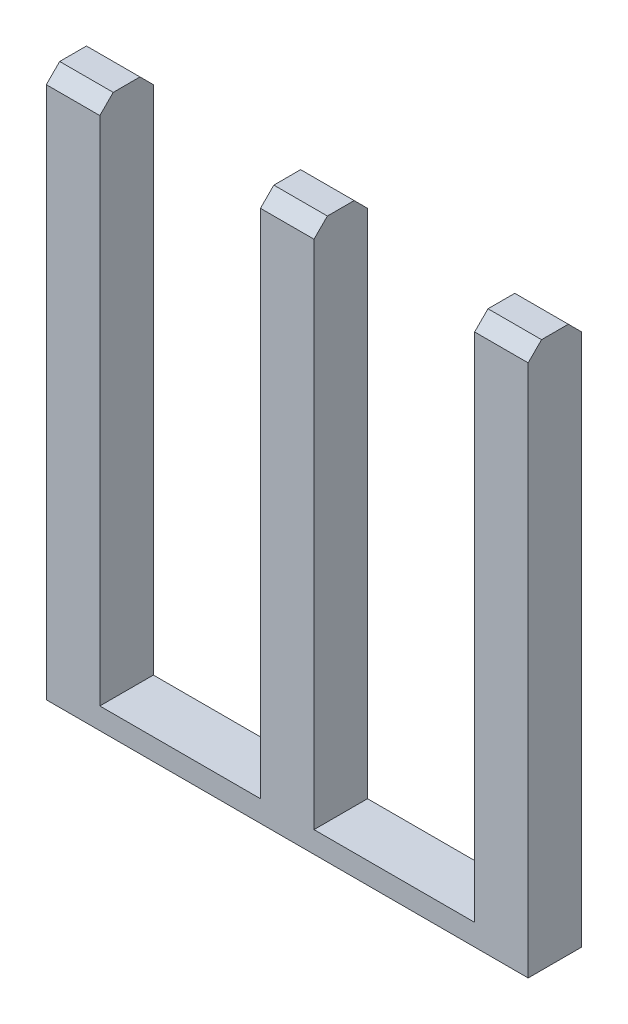
ISO-10303-21;
HEADER;
FILE_DESCRIPTION(('STEP AP214'),'2;1');
FILE_NAME('part.step','',(''),(''),'','','');
FILE_SCHEMA(('AUTOMOTIVE_DESIGN { 1 0 10303 214 1 1 1 1 }'));
ENDSEC;
DATA;
#1=APPLICATION_CONTEXT('core data for automotive mechanical design processes');
#2=APPLICATION_PROTOCOL_DEFINITION('international standard','automotive_design',2000,#1);
#3=PRODUCT_CONTEXT('',#1,'mechanical');
#4=PRODUCT('Part','Part','',(#3));
#5=PRODUCT_RELATED_PRODUCT_CATEGORY('part','',(#4));
#6=PRODUCT_DEFINITION_FORMATION('','',#4);
#7=PRODUCT_DEFINITION_CONTEXT('part definition',#1,'design');
#8=PRODUCT_DEFINITION('design','',#6,#7);
#9=PRODUCT_DEFINITION_SHAPE('','',#8);
#10=(LENGTH_UNIT() NAMED_UNIT(*) SI_UNIT(.MILLI.,.METRE.));
#11=(NAMED_UNIT(*) PLANE_ANGLE_UNIT() SI_UNIT($,.RADIAN.));
#12=(NAMED_UNIT(*) SI_UNIT($,.STERADIAN.) SOLID_ANGLE_UNIT());
#13=UNCERTAINTY_MEASURE_WITH_UNIT(LENGTH_MEASURE(1.E-05),#10,'distance_accuracy_value','');
#14=(GEOMETRIC_REPRESENTATION_CONTEXT(3) GLOBAL_UNCERTAINTY_ASSIGNED_CONTEXT((#13)) GLOBAL_UNIT_ASSIGNED_CONTEXT((#10,
#11,#12)) REPRESENTATION_CONTEXT('',''));
#15=CARTESIAN_POINT('',(0.,0.,0.));
#16=DIRECTION('',(0.,0.,1.));
#17=DIRECTION('',(1.,0.,0.));
#18=AXIS2_PLACEMENT_3D('',#15,#16,#17);
#19=CARTESIAN_POINT('',(2.8575,1.27000000000001,0.0635));
#20=DIRECTION('',(0.,0.,1.));
#21=DIRECTION('',(0.,1.,0.));
#22=AXIS2_PLACEMENT_3D('',#19,#20,#21);
#23=PLANE('',#22);
#24=DIRECTION('',(1.,0.,0.));
#25=VECTOR('',#24,1.);
#26=CARTESIAN_POINT('',(-2.8575,1.27000000000001,0.0635));
#27=LINE('',#26,#25);
#28=CARTESIAN_POINT('',(2.8575,1.27000000000001,0.0635));
#29=VERTEX_POINT('',#28);
#30=CARTESIAN_POINT('',(-2.8575,1.27000000000001,0.0635));
#31=VERTEX_POINT('',#30);
#32=EDGE_CURVE('E142',#29,#31,#27,.F.);
#33=ORIENTED_EDGE('',*,*,#32,.F.);
#34=DIRECTION('',(0.,1.,0.));
#35=VECTOR('',#34,1.);
#36=CARTESIAN_POINT('',(2.8575,1.27000000000001,0.0635));
#37=LINE('',#36,#35);
#38=CARTESIAN_POINT('',(2.8575,7.58825,0.0635));
#39=VERTEX_POINT('',#38);
#40=EDGE_CURVE('E157',#39,#29,#37,.F.);
#41=ORIENTED_EDGE('',*,*,#40,.F.);
#42=DIRECTION('',(-1.,0.,0.));
#43=VECTOR('',#42,1.);
#44=CARTESIAN_POINT('',(2.8575,7.58825,0.0635));
#45=LINE('',#44,#43);
#46=CARTESIAN_POINT('',(2.2225,7.58825,0.0635));
#47=VERTEX_POINT('',#46);
#48=EDGE_CURVE('E166',#39,#47,#45,.T.);
#49=ORIENTED_EDGE('',*,*,#48,.T.);
#50=DIRECTION('',(0.,-1.,0.));
#51=VECTOR('',#50,1.);
#52=CARTESIAN_POINT('',(2.2225,7.58825,0.0635));
#53=LINE('',#52,#51);
#54=CARTESIAN_POINT('',(2.2225,1.524,0.0635));
#55=VERTEX_POINT('',#54);
#56=EDGE_CURVE('E168',#55,#47,#53,.F.);
#57=ORIENTED_EDGE('',*,*,#56,.F.);
#58=DIRECTION('',(-1.,0.,0.));
#59=VECTOR('',#58,1.);
#60=CARTESIAN_POINT('',(2.2225,1.524,0.0635));
#61=LINE('',#60,#59);
#62=CARTESIAN_POINT('',(0.3175,1.524,0.0635));
#63=VERTEX_POINT('',#62);
#64=EDGE_CURVE('E178',#63,#55,#61,.F.);
#65=ORIENTED_EDGE('',*,*,#64,.F.);
#66=DIRECTION('',(0.,1.,0.));
#67=VECTOR('',#66,1.);
#68=CARTESIAN_POINT('',(0.3175,1.524,0.0635));
#69=LINE('',#68,#67);
#70=CARTESIAN_POINT('',(0.3175,7.58825,0.0635));
#71=VERTEX_POINT('',#70);
#72=EDGE_CURVE('E182',#71,#63,#69,.F.);
#73=ORIENTED_EDGE('',*,*,#72,.F.);
#74=DIRECTION('',(-1.,0.,0.));
#75=VECTOR('',#74,1.);
#76=CARTESIAN_POINT('',(0.3175,7.58825,0.0635));
#77=LINE('',#76,#75);
#78=CARTESIAN_POINT('',(-0.3175,7.58825,0.0635));
#79=VERTEX_POINT('',#78);
#80=EDGE_CURVE('E187',#71,#79,#77,.T.);
#81=ORIENTED_EDGE('',*,*,#80,.T.);
#82=DIRECTION('',(0.,-1.,0.));
#83=VECTOR('',#82,1.);
#84=CARTESIAN_POINT('',(-0.3175,7.58825,0.0635));
#85=LINE('',#84,#83);
#86=CARTESIAN_POINT('',(-0.3175,1.524,0.0635));
#87=VERTEX_POINT('',#86);
#88=EDGE_CURVE('E192',#87,#79,#85,.F.);
#89=ORIENTED_EDGE('',*,*,#88,.F.);
#90=DIRECTION('',(-1.,0.,0.));
#91=VECTOR('',#90,1.);
#92=CARTESIAN_POINT('',(-0.3175,1.524,0.0635));
#93=LINE('',#92,#91);
#94=CARTESIAN_POINT('',(-2.2225,1.524,0.0635));
#95=VERTEX_POINT('',#94);
#96=EDGE_CURVE('E196',#95,#87,#93,.F.);
#97=ORIENTED_EDGE('',*,*,#96,.F.);
#98=DIRECTION('',(0.,1.,0.));
#99=VECTOR('',#98,1.);
#100=CARTESIAN_POINT('',(-2.2225,1.524,0.0635));
#101=LINE('',#100,#99);
#102=CARTESIAN_POINT('',(-2.2225,7.58825,0.0635));
#103=VERTEX_POINT('',#102);
#104=EDGE_CURVE('E201',#103,#95,#101,.F.);
#105=ORIENTED_EDGE('',*,*,#104,.F.);
#106=DIRECTION('',(-1.,0.,0.));
#107=VECTOR('',#106,1.);
#108=CARTESIAN_POINT('',(-2.2225,7.58825,0.0635));
#109=LINE('',#108,#107);
#110=CARTESIAN_POINT('',(-2.8575,7.58825,0.0635));
#111=VERTEX_POINT('',#110);
#112=EDGE_CURVE('E205',#103,#111,#109,.T.);
#113=ORIENTED_EDGE('',*,*,#112,.T.);
#114=DIRECTION('',(0.,-1.,0.));
#115=VECTOR('',#114,1.);
#116=CARTESIAN_POINT('',(-2.8575,7.58825,0.0635));
#117=LINE('',#116,#115);
#118=EDGE_CURVE('E160',#111,#31,#117,.T.);
#119=ORIENTED_EDGE('',*,*,#118,.T.);
#120=EDGE_LOOP('',(#33,#41,#49,#57,#65,#73,#81,#89,#97,#105,#113,#119));
#121=FACE_BOUND('',#120,.T.);
#122=ADVANCED_FACE('F16',(#121),#23,.T.);
#123=CARTESIAN_POINT('',(-2.8575,1.27000000000001,-0.5715));
#124=DIRECTION('',(0.,0.,-1.));
#125=DIRECTION('',(0.,1.,0.));
#126=AXIS2_PLACEMENT_3D('',#123,#124,#125);
#127=PLANE('',#126);
#128=DIRECTION('',(-1.,0.,0.));
#129=VECTOR('',#128,1.);
#130=CARTESIAN_POINT('',(2.8575,1.27000000000001,-0.5715));
#131=LINE('',#130,#129);
#132=CARTESIAN_POINT('',(-2.8575,1.27000000000001,-0.5715));
#133=VERTEX_POINT('',#132);
#134=CARTESIAN_POINT('',(2.8575,1.27000000000001,-0.5715));
#135=VERTEX_POINT('',#134);
#136=EDGE_CURVE('E145',#133,#135,#131,.F.);
#137=ORIENTED_EDGE('',*,*,#136,.F.);
#138=DIRECTION('',(0.,1.,0.));
#139=VECTOR('',#138,1.);
#140=CARTESIAN_POINT('',(-2.8575,1.27000000000001,-0.5715));
#141=LINE('',#140,#139);
#142=CARTESIAN_POINT('',(-2.8575,7.58825,-0.5715));
#143=VERTEX_POINT('',#142);
#144=EDGE_CURVE('E215',#133,#143,#141,.T.);
#145=ORIENTED_EDGE('',*,*,#144,.T.);
#146=DIRECTION('',(1.,0.,0.));
#147=VECTOR('',#146,1.);
#148=CARTESIAN_POINT('',(-2.8575,7.58825,-0.5715));
#149=LINE('',#148,#147);
#150=CARTESIAN_POINT('',(-2.2225,7.58825,-0.5715));
#151=VERTEX_POINT('',#150);
#152=EDGE_CURVE('E220',#151,#143,#149,.F.);
#153=ORIENTED_EDGE('',*,*,#152,.F.);
#154=DIRECTION('',(0.,-1.,0.));
#155=VECTOR('',#154,1.);
#156=CARTESIAN_POINT('',(-2.2225,7.58825,-0.5715));
#157=LINE('',#156,#155);
#158=CARTESIAN_POINT('',(-2.2225,1.524,-0.5715));
#159=VERTEX_POINT('',#158);
#160=EDGE_CURVE('E224',#159,#151,#157,.F.);
#161=ORIENTED_EDGE('',*,*,#160,.F.);
#162=DIRECTION('',(1.,0.,0.));
#163=VECTOR('',#162,1.);
#164=CARTESIAN_POINT('',(-2.2225,1.524,-0.5715));
#165=LINE('',#164,#163);
#166=CARTESIAN_POINT('',(-0.3175,1.524,-0.5715));
#167=VERTEX_POINT('',#166);
#168=EDGE_CURVE('E228',#167,#159,#165,.F.);
#169=ORIENTED_EDGE('',*,*,#168,.F.);
#170=DIRECTION('',(0.,1.,0.));
#171=VECTOR('',#170,1.);
#172=CARTESIAN_POINT('',(-0.3175,1.524,-0.5715));
#173=LINE('',#172,#171);
#174=CARTESIAN_POINT('',(-0.3175,7.58825,-0.5715));
#175=VERTEX_POINT('',#174);
#176=EDGE_CURVE('E233',#175,#167,#173,.F.);
#177=ORIENTED_EDGE('',*,*,#176,.F.);
#178=DIRECTION('',(1.,0.,0.));
#179=VECTOR('',#178,1.);
#180=CARTESIAN_POINT('',(-0.3175,7.58825,-0.5715));
#181=LINE('',#180,#179);
#182=CARTESIAN_POINT('',(0.3175,7.58825,-0.5715));
#183=VERTEX_POINT('',#182);
#184=EDGE_CURVE('E237',#183,#175,#181,.F.);
#185=ORIENTED_EDGE('',*,*,#184,.F.);
#186=DIRECTION('',(0.,-1.,0.));
#187=VECTOR('',#186,1.);
#188=CARTESIAN_POINT('',(0.3175,7.58825,-0.5715));
#189=LINE('',#188,#187);
#190=CARTESIAN_POINT('',(0.3175,1.524,-0.5715));
#191=VERTEX_POINT('',#190);
#192=EDGE_CURVE('E242',#191,#183,#189,.F.);
#193=ORIENTED_EDGE('',*,*,#192,.F.);
#194=DIRECTION('',(1.,0.,0.));
#195=VECTOR('',#194,1.);
#196=CARTESIAN_POINT('',(0.3175,1.524,-0.5715));
#197=LINE('',#196,#195);
#198=CARTESIAN_POINT('',(2.2225,1.524,-0.5715));
#199=VERTEX_POINT('',#198);
#200=EDGE_CURVE('E246',#199,#191,#197,.F.);
#201=ORIENTED_EDGE('',*,*,#200,.F.);
#202=DIRECTION('',(0.,1.,0.));
#203=VECTOR('',#202,1.);
#204=CARTESIAN_POINT('',(2.2225,1.524,-0.5715));
#205=LINE('',#204,#203);
#206=CARTESIAN_POINT('',(2.2225,7.58825,-0.5715));
#207=VERTEX_POINT('',#206);
#208=EDGE_CURVE('E250',#207,#199,#205,.F.);
#209=ORIENTED_EDGE('',*,*,#208,.F.);
#210=DIRECTION('',(1.,0.,0.));
#211=VECTOR('',#210,1.);
#212=CARTESIAN_POINT('',(2.2225,7.58825,-0.5715));
#213=LINE('',#212,#211);
#214=CARTESIAN_POINT('',(2.8575,7.58825,-0.5715));
#215=VERTEX_POINT('',#214);
#216=EDGE_CURVE('E255',#215,#207,#213,.F.);
#217=ORIENTED_EDGE('',*,*,#216,.F.);
#218=DIRECTION('',(0.,-1.,0.));
#219=VECTOR('',#218,1.);
#220=CARTESIAN_POINT('',(2.8575,7.58825,-0.5715));
#221=LINE('',#220,#219);
#222=EDGE_CURVE('E151',#135,#215,#221,.F.);
#223=ORIENTED_EDGE('',*,*,#222,.F.);
#224=EDGE_LOOP('',(#137,#145,#153,#161,#169,#177,#185,#193,#201,#209,#217,#223));
#225=FACE_BOUND('',#224,.T.);
#226=ADVANCED_FACE('F392',(#225),#127,.T.);
#227=CARTESIAN_POINT('',(2.8575,1.27000000000001,0.0635000000000024));
#228=DIRECTION('',(1.,0.,0.));
#229=DIRECTION('',(0.,0.,-1.));
#230=AXIS2_PLACEMENT_3D('',#227,#228,#229);
#231=PLANE('',#230);
#232=ORIENTED_EDGE('',*,*,#40,.T.);
#233=DIRECTION('',(0.,0.,-1.));
#234=VECTOR('',#233,1.);
#235=CARTESIAN_POINT('',(2.8575,1.27000000000001,0.0635000000000012));
#236=LINE('',#235,#234);
#237=EDGE_CURVE('E140',#29,#135,#236,.T.);
#238=ORIENTED_EDGE('',*,*,#237,.T.);
#239=ORIENTED_EDGE('',*,*,#222,.T.);
#240=DIRECTION('',(0.,0.707106781186545,0.70710678118655));
#241=VECTOR('',#240,1.);
#242=CARTESIAN_POINT('',(2.8575,7.58825,-0.5715));
#243=LINE('',#242,#241);
#244=CARTESIAN_POINT('',(2.8575,7.747,-0.412749999999999));
#245=VERTEX_POINT('',#244);
#246=EDGE_CURVE('E150',#215,#245,#243,.T.);
#247=ORIENTED_EDGE('',*,*,#246,.T.);
#248=DIRECTION('',(0.,0.,1.));
#249=VECTOR('',#248,1.);
#250=CARTESIAN_POINT('',(2.8575,7.747,-0.41275));
#251=LINE('',#250,#249);
#252=CARTESIAN_POINT('',(2.8575,7.747,-0.0952500000000001));
#253=VERTEX_POINT('',#252);
#254=EDGE_CURVE('E269',#245,#253,#251,.T.);
#255=ORIENTED_EDGE('',*,*,#254,.T.);
#256=DIRECTION('',(0.,-0.707106781186545,0.70710678118655));
#257=VECTOR('',#256,1.);
#258=CARTESIAN_POINT('',(2.8575,7.747,-0.0952500000000001));
#259=LINE('',#258,#257);
#260=EDGE_CURVE('E165',#253,#39,#259,.T.);
#261=ORIENTED_EDGE('',*,*,#260,.T.);
#262=EDGE_LOOP('',(#232,#238,#239,#247,#255,#261));
#263=FACE_BOUND('',#262,.T.);
#264=ADVANCED_FACE('F163',(#263),#231,.T.);
#265=CARTESIAN_POINT('',(-2.8575,1.27000000000001,0.0635000000000006));
#266=DIRECTION('',(-1.,0.,0.));
#267=DIRECTION('',(0.,1.,0.));
#268=AXIS2_PLACEMENT_3D('',#265,#266,#267);
#269=PLANE('',#268);
#270=DIRECTION('',(0.,0.,1.));
#271=VECTOR('',#270,1.);
#272=CARTESIAN_POINT('',(-2.8575,1.27000000000001,-0.571499999999997));
#273=LINE('',#272,#271);
#274=EDGE_CURVE('E276',#31,#133,#273,.F.);
#275=ORIENTED_EDGE('',*,*,#274,.F.);
#276=ORIENTED_EDGE('',*,*,#118,.F.);
#277=DIRECTION('',(0.,0.707106781186545,-0.70710678118655));
#278=VECTOR('',#277,1.);
#279=CARTESIAN_POINT('',(-2.8575,7.58825,0.0635000000000006));
#280=LINE('',#279,#278);
#281=CARTESIAN_POINT('',(-2.8575,7.747,-0.0952500000000001));
#282=VERTEX_POINT('',#281);
#283=EDGE_CURVE('E280',#282,#111,#280,.F.);
#284=ORIENTED_EDGE('',*,*,#283,.F.);
#285=DIRECTION('',(0.,0.,-1.));
#286=VECTOR('',#285,1.);
#287=CARTESIAN_POINT('',(-2.8575,7.747,-0.0952500000000001));
#288=LINE('',#287,#286);
#289=CARTESIAN_POINT('',(-2.8575,7.747,-0.41275));
#290=VERTEX_POINT('',#289);
#291=EDGE_CURVE('E284',#290,#282,#288,.F.);
#292=ORIENTED_EDGE('',*,*,#291,.F.);
#293=DIRECTION('',(0.,-0.707106781186545,-0.70710678118655));
#294=VECTOR('',#293,1.);
#295=CARTESIAN_POINT('',(-2.8575,7.747,-0.412749999999999));
#296=LINE('',#295,#294);
#297=EDGE_CURVE('E289',#143,#290,#296,.F.);
#298=ORIENTED_EDGE('',*,*,#297,.F.);
#299=ORIENTED_EDGE('',*,*,#144,.F.);
#300=EDGE_LOOP('',(#275,#276,#284,#292,#298,#299));
#301=FACE_BOUND('',#300,.T.);
#302=ADVANCED_FACE('F409',(#301),#269,.T.);
#303=CARTESIAN_POINT('',(-2.8575,7.747,-0.412749999999999));
#304=DIRECTION('',(0.,0.707106781186549,-0.707106781186546));
#305=DIRECTION('',(1.,0.,0.));
#306=AXIS2_PLACEMENT_3D('',#303,#304,#305);
#307=PLANE('',#306);
#308=DIRECTION('',(0.,-0.707106781186546,-0.707106781186549));
#309=VECTOR('',#308,1.);
#310=CARTESIAN_POINT('',(-2.2225,7.747,-0.41275));
#311=LINE('',#310,#309);
#312=CARTESIAN_POINT('',(-2.2225,7.747,-0.41275));
#313=VERTEX_POINT('',#312);
#314=EDGE_CURVE('E294',#151,#313,#311,.F.);
#315=ORIENTED_EDGE('',*,*,#314,.F.);
#316=ORIENTED_EDGE('',*,*,#152,.T.);
#317=ORIENTED_EDGE('',*,*,#297,.T.);
#318=DIRECTION('',(1.,0.,0.));
#319=VECTOR('',#318,1.);
#320=CARTESIAN_POINT('',(-2.8575,7.747,-0.412749999999999));
#321=LINE('',#320,#319);
#322=EDGE_CURVE('E298',#313,#290,#321,.F.);
#323=ORIENTED_EDGE('',*,*,#322,.F.);
#324=EDGE_LOOP('',(#315,#316,#317,#323));
#325=FACE_BOUND('',#324,.T.);
#326=ADVANCED_FACE('F401',(#325),#307,.T.);
#327=CARTESIAN_POINT('',(-0.3175,7.747,-0.412749999999999));
#328=DIRECTION('',(0.,0.707106781186549,-0.707106781186546));
#329=DIRECTION('',(1.,0.,0.));
#330=AXIS2_PLACEMENT_3D('',#327,#328,#329);
#331=PLANE('',#330);
#332=DIRECTION('',(0.,0.707106781186546,0.707106781186549));
#333=VECTOR('',#332,1.);
#334=CARTESIAN_POINT('',(-0.3175,7.58825,-0.5715));
#335=LINE('',#334,#333);
#336=CARTESIAN_POINT('',(-0.3175,7.747,-0.41275));
#337=VERTEX_POINT('',#336);
#338=EDGE_CURVE('E302',#337,#175,#335,.F.);
#339=ORIENTED_EDGE('',*,*,#338,.F.);
#340=DIRECTION('',(1.,0.,0.));
#341=VECTOR('',#340,1.);
#342=CARTESIAN_POINT('',(-0.3175,7.747,-0.412749999999999));
#343=LINE('',#342,#341);
#344=CARTESIAN_POINT('',(0.3175,7.747,-0.41275));
#345=VERTEX_POINT('',#344);
#346=EDGE_CURVE('E306',#345,#337,#343,.F.);
#347=ORIENTED_EDGE('',*,*,#346,.F.);
#348=DIRECTION('',(0.,-0.707106781186546,-0.707106781186549));
#349=VECTOR('',#348,1.);
#350=CARTESIAN_POINT('',(0.3175,7.747,-0.41275));
#351=LINE('',#350,#349);
#352=EDGE_CURVE('E311',#183,#345,#351,.F.);
#353=ORIENTED_EDGE('',*,*,#352,.F.);
#354=ORIENTED_EDGE('',*,*,#184,.T.);
#355=EDGE_LOOP('',(#339,#347,#353,#354));
#356=FACE_BOUND('',#355,.T.);
#357=ADVANCED_FACE('F429',(#356),#331,.T.);
#358=CARTESIAN_POINT('',(2.2225,7.747,-0.412749999999999));
#359=DIRECTION('',(0.,0.707106781186549,-0.707106781186546));
#360=DIRECTION('',(1.,0.,0.));
#361=AXIS2_PLACEMENT_3D('',#358,#359,#360);
#362=PLANE('',#361);
#363=DIRECTION('',(0.,0.707106781186546,0.707106781186549));
#364=VECTOR('',#363,1.);
#365=CARTESIAN_POINT('',(2.2225,7.58825,-0.5715));
#366=LINE('',#365,#364);
#367=CARTESIAN_POINT('',(2.2225,7.747,-0.41275));
#368=VERTEX_POINT('',#367);
#369=EDGE_CURVE('E315',#368,#207,#366,.F.);
#370=ORIENTED_EDGE('',*,*,#369,.F.);
#371=DIRECTION('',(1.,0.,0.));
#372=VECTOR('',#371,1.);
#373=CARTESIAN_POINT('',(2.2225,7.747,-0.412749999999999));
#374=LINE('',#373,#372);
#375=EDGE_CURVE('E319',#245,#368,#374,.F.);
#376=ORIENTED_EDGE('',*,*,#375,.F.);
#377=ORIENTED_EDGE('',*,*,#246,.F.);
#378=ORIENTED_EDGE('',*,*,#216,.T.);
#379=EDGE_LOOP('',(#370,#376,#377,#378));
#380=FACE_BOUND('',#379,.T.);
#381=ADVANCED_FACE('F450',(#380),#362,.T.);
#382=CARTESIAN_POINT('',(-2.8575,7.747,-0.09525));
#383=DIRECTION('',(0.,1.,0.));
#384=DIRECTION('',(1.,0.,0.));
#385=AXIS2_PLACEMENT_3D('',#382,#383,#384);
#386=PLANE('',#385);
#387=DIRECTION('',(0.,0.,-1.));
#388=VECTOR('',#387,1.);
#389=CARTESIAN_POINT('',(-2.2225,7.747,-0.09525));
#390=LINE('',#389,#388);
#391=CARTESIAN_POINT('',(-2.2225,7.747,-0.09525));
#392=VERTEX_POINT('',#391);
#393=EDGE_CURVE('E324',#313,#392,#390,.F.);
#394=ORIENTED_EDGE('',*,*,#393,.F.);
#395=ORIENTED_EDGE('',*,*,#322,.T.);
#396=ORIENTED_EDGE('',*,*,#291,.T.);
#397=DIRECTION('',(1.,0.,0.));
#398=VECTOR('',#397,1.);
#399=CARTESIAN_POINT('',(-2.8575,7.747,-0.09525));
#400=LINE('',#399,#398);
#401=EDGE_CURVE('E328',#392,#282,#400,.F.);
#402=ORIENTED_EDGE('',*,*,#401,.F.);
#403=EDGE_LOOP('',(#394,#395,#396,#402));
#404=FACE_BOUND('',#403,.T.);
#405=ADVANCED_FACE('F405',(#404),#386,.T.);
#406=CARTESIAN_POINT('',(-0.3175,7.747,-0.09525));
#407=DIRECTION('',(0.,1.,0.));
#408=DIRECTION('',(1.,0.,0.));
#409=AXIS2_PLACEMENT_3D('',#406,#407,#408);
#410=PLANE('',#409);
#411=DIRECTION('',(0.,0.,1.));
#412=VECTOR('',#411,1.);
#413=CARTESIAN_POINT('',(-0.3175,7.747,-0.41275));
#414=LINE('',#413,#412);
#415=CARTESIAN_POINT('',(-0.3175,7.747,-0.09525));
#416=VERTEX_POINT('',#415);
#417=EDGE_CURVE('E332',#416,#337,#414,.F.);
#418=ORIENTED_EDGE('',*,*,#417,.F.);
#419=DIRECTION('',(1.,0.,0.));
#420=VECTOR('',#419,1.);
#421=CARTESIAN_POINT('',(-0.3175,7.747,-0.09525));
#422=LINE('',#421,#420);
#423=CARTESIAN_POINT('',(0.3175,7.747,-0.09525));
#424=VERTEX_POINT('',#423);
#425=EDGE_CURVE('E336',#424,#416,#422,.F.);
#426=ORIENTED_EDGE('',*,*,#425,.F.);
#427=DIRECTION('',(0.,0.,-1.));
#428=VECTOR('',#427,1.);
#429=CARTESIAN_POINT('',(0.3175,7.747,-0.09525));
#430=LINE('',#429,#428);
#431=EDGE_CURVE('E40',#345,#424,#430,.F.);
#432=ORIENTED_EDGE('',*,*,#431,.F.);
#433=ORIENTED_EDGE('',*,*,#346,.T.);
#434=EDGE_LOOP('',(#418,#426,#432,#433));
#435=FACE_BOUND('',#434,.T.);
#436=ADVANCED_FACE('F425',(#435),#410,.T.);
#437=CARTESIAN_POINT('',(2.2225,7.747,-0.09525));
#438=DIRECTION('',(0.,1.,0.));
#439=DIRECTION('',(1.,0.,0.));
#440=AXIS2_PLACEMENT_3D('',#437,#438,#439);
#441=PLANE('',#440);
#442=DIRECTION('',(0.,0.,1.));
#443=VECTOR('',#442,1.);
#444=CARTESIAN_POINT('',(2.2225,7.747,-0.41275));
#445=LINE('',#444,#443);
#446=CARTESIAN_POINT('',(2.2225,7.747,-0.09525));
#447=VERTEX_POINT('',#446);
#448=EDGE_CURVE('E344',#447,#368,#445,.F.);
#449=ORIENTED_EDGE('',*,*,#448,.F.);
#450=DIRECTION('',(1.,0.,0.));
#451=VECTOR('',#450,1.);
#452=CARTESIAN_POINT('',(2.2225,7.747,-0.09525));
#453=LINE('',#452,#451);
#454=EDGE_CURVE('E348',#253,#447,#453,.F.);
#455=ORIENTED_EDGE('',*,*,#454,.F.);
#456=ORIENTED_EDGE('',*,*,#254,.F.);
#457=ORIENTED_EDGE('',*,*,#375,.T.);
#458=EDGE_LOOP('',(#449,#455,#456,#457));
#459=FACE_BOUND('',#458,.T.);
#460=ADVANCED_FACE('F445',(#459),#441,.T.);
#461=CARTESIAN_POINT('',(-2.8575,7.58825,0.0635000000000013));
#462=DIRECTION('',(0.,0.707106781186549,0.707106781186546));
#463=DIRECTION('',(1.,0.,0.));
#464=AXIS2_PLACEMENT_3D('',#461,#462,#463);
#465=PLANE('',#464);
#466=DIRECTION('',(0.,0.707106781186546,-0.70710678118655));
#467=VECTOR('',#466,1.);
#468=CARTESIAN_POINT('',(-2.2225,7.58825,0.0635000000000013));
#469=LINE('',#468,#467);
#470=EDGE_CURVE('E353',#392,#103,#469,.F.);
#471=ORIENTED_EDGE('',*,*,#470,.F.);
#472=ORIENTED_EDGE('',*,*,#401,.T.);
#473=ORIENTED_EDGE('',*,*,#283,.T.);
#474=ORIENTED_EDGE('',*,*,#112,.F.);
#475=EDGE_LOOP('',(#471,#472,#473,#474));
#476=FACE_BOUND('',#475,.T.);
#477=ADVANCED_FACE('F414',(#476),#465,.T.);
#478=CARTESIAN_POINT('',(-0.3175,7.58825,0.0635000000000013));
#479=DIRECTION('',(0.,0.707106781186549,0.707106781186546));
#480=DIRECTION('',(1.,0.,0.));
#481=AXIS2_PLACEMENT_3D('',#478,#479,#480);
#482=PLANE('',#481);
#483=DIRECTION('',(0.,-0.707106781186546,0.707106781186549));
#484=VECTOR('',#483,1.);
#485=CARTESIAN_POINT('',(-0.3175,7.747,-0.0952500000000001));
#486=LINE('',#485,#484);
#487=EDGE_CURVE('E357',#79,#416,#486,.F.);
#488=ORIENTED_EDGE('',*,*,#487,.F.);
#489=ORIENTED_EDGE('',*,*,#80,.F.);
#490=DIRECTION('',(0.,0.707106781186545,-0.70710678118655));
#491=VECTOR('',#490,1.);
#492=CARTESIAN_POINT('',(0.3175,7.58825,0.0635000000000013));
#493=LINE('',#492,#491);
#494=EDGE_CURVE('E361',#424,#71,#493,.F.);
#495=ORIENTED_EDGE('',*,*,#494,.F.);
#496=ORIENTED_EDGE('',*,*,#425,.T.);
#497=EDGE_LOOP('',(#488,#489,#495,#496));
#498=FACE_BOUND('',#497,.T.);
#499=ADVANCED_FACE('F422',(#498),#482,.T.);
#500=CARTESIAN_POINT('',(2.2225,7.58825,0.0635000000000011));
#501=DIRECTION('',(0.,0.707106781186549,0.707106781186546));
#502=DIRECTION('',(1.,0.,0.));
#503=AXIS2_PLACEMENT_3D('',#500,#501,#502);
#504=PLANE('',#503);
#505=DIRECTION('',(0.,-0.707106781186546,0.707106781186549));
#506=VECTOR('',#505,1.);
#507=CARTESIAN_POINT('',(2.2225,7.747,-0.09525));
#508=LINE('',#507,#506);
#509=EDGE_CURVE('E32',#47,#447,#508,.F.);
#510=ORIENTED_EDGE('',*,*,#509,.F.);
#511=ORIENTED_EDGE('',*,*,#48,.F.);
#512=ORIENTED_EDGE('',*,*,#260,.F.);
#513=ORIENTED_EDGE('',*,*,#454,.T.);
#514=EDGE_LOOP('',(#510,#511,#512,#513));
#515=FACE_BOUND('',#514,.T.);
#516=ADVANCED_FACE('F442',(#515),#504,.T.);
#517=CARTESIAN_POINT('',(2.2225,1.524,-0.5715));
#518=DIRECTION('',(-1.,0.,0.));
#519=DIRECTION('',(0.,0.,1.));
#520=AXIS2_PLACEMENT_3D('',#517,#518,#519);
#521=PLANE('',#520);
#522=ORIENTED_EDGE('',*,*,#56,.T.);
#523=ORIENTED_EDGE('',*,*,#509,.T.);
#524=ORIENTED_EDGE('',*,*,#448,.T.);
#525=ORIENTED_EDGE('',*,*,#369,.T.);
#526=ORIENTED_EDGE('',*,*,#208,.T.);
#527=DIRECTION('',(0.,0.,1.));
#528=VECTOR('',#527,1.);
#529=CARTESIAN_POINT('',(2.2225,1.524,-0.5715));
#530=LINE('',#529,#528);
#531=EDGE_CURVE('E368',#55,#199,#530,.F.);
#532=ORIENTED_EDGE('',*,*,#531,.F.);
#533=EDGE_LOOP('',(#522,#523,#524,#525,#526,#532));
#534=FACE_BOUND('',#533,.T.);
#535=ADVANCED_FACE('F440',(#534),#521,.T.);
#536=CARTESIAN_POINT('',(0.3175,1.524,0.0635000000000012));
#537=DIRECTION('',(1.,0.,0.));
#538=DIRECTION('',(0.,0.,-1.));
#539=AXIS2_PLACEMENT_3D('',#536,#537,#538);
#540=PLANE('',#539);
#541=ORIENTED_EDGE('',*,*,#72,.T.);
#542=DIRECTION('',(0.,0.,-1.));
#543=VECTOR('',#542,1.);
#544=CARTESIAN_POINT('',(0.3175,1.524,0.0634999999999999));
#545=LINE('',#544,#543);
#546=EDGE_CURVE('E372',#63,#191,#545,.T.);
#547=ORIENTED_EDGE('',*,*,#546,.T.);
#548=ORIENTED_EDGE('',*,*,#192,.T.);
#549=ORIENTED_EDGE('',*,*,#352,.T.);
#550=ORIENTED_EDGE('',*,*,#431,.T.);
#551=ORIENTED_EDGE('',*,*,#494,.T.);
#552=EDGE_LOOP('',(#541,#547,#548,#549,#550,#551));
#553=FACE_BOUND('',#552,.T.);
#554=ADVANCED_FACE('F434',(#553),#540,.T.);
#555=CARTESIAN_POINT('',(0.3175,1.524,-0.5715));
#556=DIRECTION('',(0.,1.,0.));
#557=DIRECTION('',(0.,0.,1.));
#558=AXIS2_PLACEMENT_3D('',#555,#556,#557);
#559=PLANE('',#558);
#560=ORIENTED_EDGE('',*,*,#64,.T.);
#561=ORIENTED_EDGE('',*,*,#531,.T.);
#562=ORIENTED_EDGE('',*,*,#200,.T.);
#563=ORIENTED_EDGE('',*,*,#546,.F.);
#564=EDGE_LOOP('',(#560,#561,#562,#563));
#565=FACE_BOUND('',#564,.T.);
#566=ADVANCED_FACE('F437',(#565),#559,.T.);
#567=CARTESIAN_POINT('',(-2.2225,1.524,-0.5715));
#568=DIRECTION('',(0.,1.,0.));
#569=DIRECTION('',(0.,0.,1.));
#570=AXIS2_PLACEMENT_3D('',#567,#568,#569);
#571=PLANE('',#570);
#572=ORIENTED_EDGE('',*,*,#96,.T.);
#573=DIRECTION('',(0.,0.,-1.));
#574=VECTOR('',#573,1.);
#575=CARTESIAN_POINT('',(-0.3175,1.524,0.0635000000000006));
#576=LINE('',#575,#574);
#577=EDGE_CURVE('E25',#87,#167,#576,.T.);
#578=ORIENTED_EDGE('',*,*,#577,.T.);
#579=ORIENTED_EDGE('',*,*,#168,.T.);
#580=DIRECTION('',(0.,0.,1.));
#581=VECTOR('',#580,1.);
#582=CARTESIAN_POINT('',(-2.2225,1.524,-0.5715));
#583=LINE('',#582,#581);
#584=EDGE_CURVE('E11',#95,#159,#583,.F.);
#585=ORIENTED_EDGE('',*,*,#584,.F.);
#586=EDGE_LOOP('',(#572,#578,#579,#585));
#587=FACE_BOUND('',#586,.T.);
#588=ADVANCED_FACE('F384',(#587),#571,.T.);
#589=CARTESIAN_POINT('',(-2.2225,1.524,0.0635000000000012));
#590=DIRECTION('',(1.,0.,0.));
#591=DIRECTION('',(0.,0.,-1.));
#592=AXIS2_PLACEMENT_3D('',#589,#590,#591);
#593=PLANE('',#592);
#594=ORIENTED_EDGE('',*,*,#104,.T.);
#595=ORIENTED_EDGE('',*,*,#584,.T.);
#596=ORIENTED_EDGE('',*,*,#160,.T.);
#597=ORIENTED_EDGE('',*,*,#314,.T.);
#598=ORIENTED_EDGE('',*,*,#393,.T.);
#599=ORIENTED_EDGE('',*,*,#470,.T.);
#600=EDGE_LOOP('',(#594,#595,#596,#597,#598,#599));
#601=FACE_BOUND('',#600,.T.);
#602=ADVANCED_FACE('F397',(#601),#593,.T.);
#603=CARTESIAN_POINT('',(-0.3175,1.524,-0.5715));
#604=DIRECTION('',(-1.,0.,0.));
#605=DIRECTION('',(0.,0.,1.));
#606=AXIS2_PLACEMENT_3D('',#603,#604,#605);
#607=PLANE('',#606);
#608=ORIENTED_EDGE('',*,*,#88,.T.);
#609=ORIENTED_EDGE('',*,*,#487,.T.);
#610=ORIENTED_EDGE('',*,*,#417,.T.);
#611=ORIENTED_EDGE('',*,*,#338,.T.);
#612=ORIENTED_EDGE('',*,*,#176,.T.);
#613=ORIENTED_EDGE('',*,*,#577,.F.);
#614=EDGE_LOOP('',(#608,#609,#610,#611,#612,#613));
#615=FACE_BOUND('',#614,.T.);
#616=ADVANCED_FACE('F419',(#615),#607,.T.);
#617=CARTESIAN_POINT('',(-2.8575,1.27000000000001,0.0635000000000012));
#618=DIRECTION('',(0.,-1.,0.));
#619=DIRECTION('',(0.,0.,-1.));
#620=AXIS2_PLACEMENT_3D('',#617,#618,#619);
#621=PLANE('',#620);
#622=ORIENTED_EDGE('',*,*,#32,.T.);
#623=ORIENTED_EDGE('',*,*,#274,.T.);
#624=ORIENTED_EDGE('',*,*,#136,.T.);
#625=ORIENTED_EDGE('',*,*,#237,.F.);
#626=EDGE_LOOP('',(#622,#623,#624,#625));
#627=FACE_BOUND('',#626,.T.);
#628=ADVANCED_FACE('F18',(#627),#621,.T.);
#629=CLOSED_SHELL('',(#122,#226,#264,#302,#326,#357,#381,#405,#436,#460,#477,#499,#516,#535,
#554,#566,#588,#602,#616,#628));
#630=MANIFOLD_SOLID_BREP('B1',#629);
#631=ADVANCED_BREP_SHAPE_REPRESENTATION('',(#18,#630),#14);
#632=SHAPE_DEFINITION_REPRESENTATION(#9,#631);
ENDSEC;
END-ISO-10303-21;
